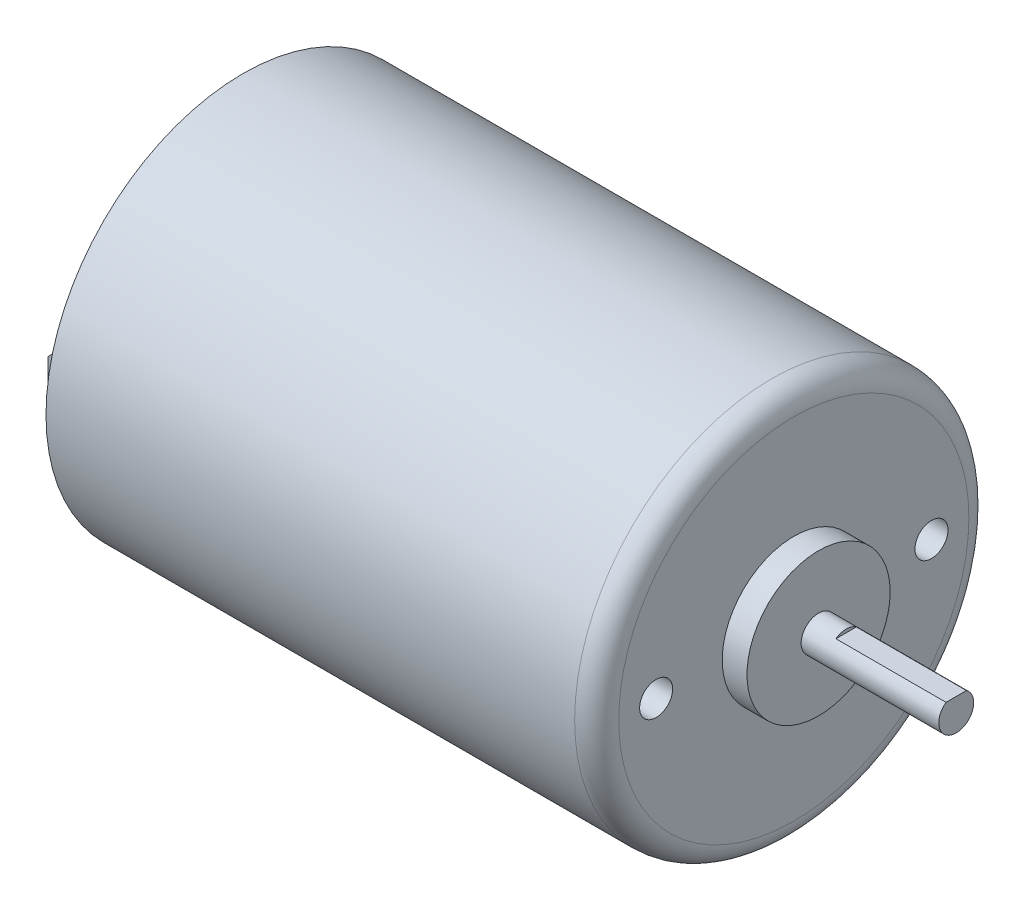
ISO-10303-21;
HEADER;
FILE_DESCRIPTION(('STEP AP214'),'2;1');
FILE_NAME('part.step','',(''),(''),'','','');
FILE_SCHEMA(('AUTOMOTIVE_DESIGN { 1 0 10303 214 1 1 1 1 }'));
ENDSEC;
DATA;
#1=APPLICATION_CONTEXT('core data for automotive mechanical design processes');
#2=APPLICATION_PROTOCOL_DEFINITION('international standard','automotive_design',2000,#1);
#3=PRODUCT_CONTEXT('',#1,'mechanical');
#4=PRODUCT('Part','Part','',(#3));
#5=PRODUCT_RELATED_PRODUCT_CATEGORY('part','',(#4));
#6=PRODUCT_DEFINITION_FORMATION('','',#4);
#7=PRODUCT_DEFINITION_CONTEXT('part definition',#1,'design');
#8=PRODUCT_DEFINITION('design','',#6,#7);
#9=PRODUCT_DEFINITION_SHAPE('','',#8);
#10=(LENGTH_UNIT() NAMED_UNIT(*) SI_UNIT(.MILLI.,.METRE.));
#11=(NAMED_UNIT(*) PLANE_ANGLE_UNIT() SI_UNIT($,.RADIAN.));
#12=(NAMED_UNIT(*) SI_UNIT($,.STERADIAN.) SOLID_ANGLE_UNIT());
#13=UNCERTAINTY_MEASURE_WITH_UNIT(LENGTH_MEASURE(1.E-05),#10,'distance_accuracy_value','');
#14=(GEOMETRIC_REPRESENTATION_CONTEXT(3) GLOBAL_UNCERTAINTY_ASSIGNED_CONTEXT((#13)) GLOBAL_UNIT_ASSIGNED_CONTEXT((#10,
#11,#12)) REPRESENTATION_CONTEXT('',''));
#15=CARTESIAN_POINT('',(0.,0.,0.));
#16=DIRECTION('',(0.,0.,1.));
#17=DIRECTION('',(1.,0.,0.));
#18=AXIS2_PLACEMENT_3D('',#15,#16,#17);
#19=CARTESIAN_POINT('',(-24.5,0.,0.));
#20=DIRECTION('',(-1.,0.,0.));
#21=DIRECTION('',(0.,0.,1.));
#22=AXIS2_PLACEMENT_3D('',#19,#20,#21);
#23=PLANE('',#22);
#24=CARTESIAN_POINT('',(-24.5,0.,0.));
#25=DIRECTION('',(-1.,0.,0.));
#26=DIRECTION('',(0.,0.,1.));
#27=AXIS2_PLACEMENT_3D('',#24,#25,#26);
#28=CIRCLE('',#27,12.);
#29=CARTESIAN_POINT('',(-24.5,0.,12.));
#30=VERTEX_POINT('',#29);
#31=EDGE_CURVE('E249',#30,#30,#28,.F.);
#32=ORIENTED_EDGE('',*,*,#31,.T.);
#33=EDGE_LOOP('',(#32));
#34=FACE_BOUND('',#33,.T.);
#35=CARTESIAN_POINT('',(-24.5,0.,0.));
#36=DIRECTION('',(-1.,0.,0.));
#37=DIRECTION('',(0.,0.,1.));
#38=AXIS2_PLACEMENT_3D('',#35,#36,#37);
#39=CIRCLE('',#38,17.2);
#40=CARTESIAN_POINT('',(-24.5,0.,17.2));
#41=VERTEX_POINT('',#40);
#42=EDGE_CURVE('E250',#41,#41,#39,.T.);
#43=ORIENTED_EDGE('',*,*,#42,.T.);
#44=EDGE_LOOP('',(#43));
#45=FACE_BOUND('',#44,.T.);
#46=DIRECTION('',(0.,0.,-1.));
#47=VECTOR('',#46,1.);
#48=CARTESIAN_POINT('',(-24.5,2.00000000000001,-14.2));
#49=LINE('',#48,#47);
#50=CARTESIAN_POINT('',(-24.5,2.00000000000001,-13.7));
#51=VERTEX_POINT('',#50);
#52=CARTESIAN_POINT('',(-24.5,2.00000000000001,-14.2));
#53=VERTEX_POINT('',#52);
#54=EDGE_CURVE('E226',#51,#53,#49,.T.);
#55=ORIENTED_EDGE('',*,*,#54,.F.);
#56=DIRECTION('',(0.,1.,0.));
#57=VECTOR('',#56,1.);
#58=CARTESIAN_POINT('',(-24.5,2.00000000000001,-13.7));
#59=LINE('',#58,#57);
#60=CARTESIAN_POINT('',(-24.5,-1.99999999999999,-13.7));
#61=VERTEX_POINT('',#60);
#62=EDGE_CURVE('E211',#61,#51,#59,.T.);
#63=ORIENTED_EDGE('',*,*,#62,.F.);
#64=DIRECTION('',(0.,0.,1.));
#65=VECTOR('',#64,1.);
#66=CARTESIAN_POINT('',(-24.5,-1.99999999999999,-14.2));
#67=LINE('',#66,#65);
#68=CARTESIAN_POINT('',(-24.5,-1.99999999999999,-14.2));
#69=VERTEX_POINT('',#68);
#70=EDGE_CURVE('E220',#69,#61,#67,.T.);
#71=ORIENTED_EDGE('',*,*,#70,.F.);
#72=DIRECTION('',(0.,-1.,0.));
#73=VECTOR('',#72,1.);
#74=CARTESIAN_POINT('',(-24.5,2.00000000000001,-14.2));
#75=LINE('',#74,#73);
#76=EDGE_CURVE('E229',#53,#69,#75,.T.);
#77=ORIENTED_EDGE('',*,*,#76,.F.);
#78=EDGE_LOOP('',(#55,#63,#71,#77));
#79=FACE_BOUND('',#78,.T.);
#80=DIRECTION('',(0.,0.,-1.));
#81=VECTOR('',#80,1.);
#82=CARTESIAN_POINT('',(-24.5,2.00000000000001,14.2));
#83=LINE('',#82,#81);
#84=CARTESIAN_POINT('',(-24.5,2.00000000000001,14.2));
#85=VERTEX_POINT('',#84);
#86=CARTESIAN_POINT('',(-24.5,2.00000000000001,13.7));
#87=VERTEX_POINT('',#86);
#88=EDGE_CURVE('E205',#85,#87,#83,.T.);
#89=ORIENTED_EDGE('',*,*,#88,.F.);
#90=DIRECTION('',(0.,1.,0.));
#91=VECTOR('',#90,1.);
#92=CARTESIAN_POINT('',(-24.5,2.00000000000001,14.2));
#93=LINE('',#92,#91);
#94=CARTESIAN_POINT('',(-24.5,-1.99999999999999,14.2));
#95=VERTEX_POINT('',#94);
#96=EDGE_CURVE('E208',#95,#85,#93,.T.);
#97=ORIENTED_EDGE('',*,*,#96,.F.);
#98=DIRECTION('',(0.,0.,1.));
#99=VECTOR('',#98,1.);
#100=CARTESIAN_POINT('',(-24.5,-1.99999999999999,14.2));
#101=LINE('',#100,#99);
#102=CARTESIAN_POINT('',(-24.5,-1.99999999999999,13.7));
#103=VERTEX_POINT('',#102);
#104=EDGE_CURVE('E198',#103,#95,#101,.T.);
#105=ORIENTED_EDGE('',*,*,#104,.F.);
#106=DIRECTION('',(0.,-1.,0.));
#107=VECTOR('',#106,1.);
#108=CARTESIAN_POINT('',(-24.5,2.00000000000001,13.7));
#109=LINE('',#108,#107);
#110=EDGE_CURVE('E201',#87,#103,#109,.T.);
#111=ORIENTED_EDGE('',*,*,#110,.F.);
#112=EDGE_LOOP('',(#89,#97,#105,#111));
#113=FACE_BOUND('',#112,.T.);
#114=ADVANCED_FACE('F49',(#34,#45,#79,#113),#23,.T.);
#115=CARTESIAN_POINT('',(25.,0.,0.));
#116=DIRECTION('',(-1.,0.,0.));
#117=DIRECTION('',(0.,0.,1.));
#118=AXIS2_PLACEMENT_3D('',#115,#116,#117);
#119=CYLINDRICAL_SURFACE('',#118,17.9);
#120=CARTESIAN_POINT('',(23.,0.,0.));
#121=DIRECTION('',(1.,0.,0.));
#122=DIRECTION('',(0.,0.,-1.));
#123=AXIS2_PLACEMENT_3D('',#120,#121,#122);
#124=CIRCLE('',#123,17.9);
#125=CARTESIAN_POINT('',(23.,0.,-17.9));
#126=VERTEX_POINT('',#125);
#127=EDGE_CURVE('E267',#126,#126,#124,.F.);
#128=ORIENTED_EDGE('',*,*,#127,.T.);
#129=EDGE_LOOP('',(#128));
#130=FACE_BOUND('',#129,.T.);
#131=CARTESIAN_POINT('',(-25.,0.,0.));
#132=DIRECTION('',(1.,0.,0.));
#133=DIRECTION('',(0.,0.,-1.));
#134=AXIS2_PLACEMENT_3D('',#131,#132,#133);
#135=CIRCLE('',#134,17.9);
#136=CARTESIAN_POINT('',(-25.,0.,-17.9));
#137=VERTEX_POINT('',#136);
#138=EDGE_CURVE('E253',#137,#137,#135,.T.);
#139=ORIENTED_EDGE('',*,*,#138,.T.);
#140=EDGE_LOOP('',(#139));
#141=FACE_BOUND('',#140,.T.);
#142=ADVANCED_FACE('F331',(#130,#141),#119,.T.);
#143=CARTESIAN_POINT('',(25.,0.,0.));
#144=DIRECTION('',(1.,0.,0.));
#145=DIRECTION('',(0.,0.,-1.));
#146=AXIS2_PLACEMENT_3D('',#143,#144,#145);
#147=PLANE('',#146);
#148=CARTESIAN_POINT('',(25.,0.,0.));
#149=DIRECTION('',(1.,0.,0.));
#150=DIRECTION('',(0.,0.,-1.));
#151=AXIS2_PLACEMENT_3D('',#148,#149,#150);
#152=CIRCLE('',#151,6.5);
#153=CARTESIAN_POINT('',(25.,0.,-6.5));
#154=VERTEX_POINT('',#153);
#155=EDGE_CURVE('E54',#154,#154,#152,.F.);
#156=ORIENTED_EDGE('',*,*,#155,.T.);
#157=EDGE_LOOP('',(#156));
#158=FACE_BOUND('',#157,.T.);
#159=CARTESIAN_POINT('',(25.,0.,12.5));
#160=DIRECTION('',(1.,0.,0.));
#161=DIRECTION('',(0.,0.,-1.));
#162=AXIS2_PLACEMENT_3D('',#159,#160,#161);
#163=CIRCLE('',#162,1.5);
#164=CARTESIAN_POINT('',(25.,0.,11.));
#165=VERTEX_POINT('',#164);
#166=EDGE_CURVE('E181',#165,#165,#163,.T.);
#167=ORIENTED_EDGE('',*,*,#166,.F.);
#168=EDGE_LOOP('',(#167));
#169=FACE_BOUND('',#168,.T.);
#170=CARTESIAN_POINT('',(25.,0.,-12.5));
#171=DIRECTION('',(1.,0.,0.));
#172=DIRECTION('',(0.,0.,1.));
#173=AXIS2_PLACEMENT_3D('',#170,#171,#172);
#174=CIRCLE('',#173,1.5);
#175=CARTESIAN_POINT('',(25.,0.,-11.));
#176=VERTEX_POINT('',#175);
#177=EDGE_CURVE('E184',#176,#176,#174,.T.);
#178=ORIENTED_EDGE('',*,*,#177,.F.);
#179=EDGE_LOOP('',(#178));
#180=FACE_BOUND('',#179,.T.);
#181=CARTESIAN_POINT('',(25.,0.,0.));
#182=DIRECTION('',(1.,0.,0.));
#183=DIRECTION('',(0.,0.,-1.));
#184=AXIS2_PLACEMENT_3D('',#181,#182,#183);
#185=CIRCLE('',#184,15.9);
#186=CARTESIAN_POINT('',(25.,0.,-15.9));
#187=VERTEX_POINT('',#186);
#188=EDGE_CURVE('E259',#187,#187,#185,.T.);
#189=ORIENTED_EDGE('',*,*,#188,.T.);
#190=EDGE_LOOP('',(#189));
#191=FACE_BOUND('',#190,.T.);
#192=ADVANCED_FACE('F390',(#158,#169,#180,#191),#147,.T.);
#193=CARTESIAN_POINT('',(-25.,0.,0.));
#194=DIRECTION('',(1.,0.,0.));
#195=DIRECTION('',(0.,0.,-1.));
#196=AXIS2_PLACEMENT_3D('',#193,#194,#195);
#197=PLANE('',#196);
#198=CARTESIAN_POINT('',(-25.,0.,0.));
#199=DIRECTION('',(-1.,0.,0.));
#200=DIRECTION('',(0.,0.,1.));
#201=AXIS2_PLACEMENT_3D('',#198,#199,#200);
#202=CIRCLE('',#201,17.2);
#203=CARTESIAN_POINT('',(-25.,0.,17.2));
#204=VERTEX_POINT('',#203);
#205=EDGE_CURVE('E254',#204,#204,#202,.T.);
#206=ORIENTED_EDGE('',*,*,#205,.F.);
#207=EDGE_LOOP('',(#206));
#208=FACE_BOUND('',#207,.T.);
#209=ORIENTED_EDGE('',*,*,#138,.F.);
#210=EDGE_LOOP('',(#209));
#211=FACE_BOUND('',#210,.T.);
#212=ADVANCED_FACE('F392',(#208,#211),#197,.F.);
#213=CARTESIAN_POINT('',(-24.5,0.,0.));
#214=DIRECTION('',(-1.,0.,0.));
#215=DIRECTION('',(0.,0.,1.));
#216=AXIS2_PLACEMENT_3D('',#213,#214,#215);
#217=CYLINDRICAL_SURFACE('',#216,17.2);
#218=ORIENTED_EDGE('',*,*,#42,.F.);
#219=EDGE_LOOP('',(#218));
#220=FACE_BOUND('',#219,.T.);
#221=ORIENTED_EDGE('',*,*,#205,.T.);
#222=EDGE_LOOP('',(#221));
#223=FACE_BOUND('',#222,.T.);
#224=ADVANCED_FACE('F395',(#220,#223),#217,.F.);
#225=CARTESIAN_POINT('',(-25.,0.,0.));
#226=DIRECTION('',(1.,0.,0.));
#227=DIRECTION('',(0.,0.,-1.));
#228=AXIS2_PLACEMENT_3D('',#225,#226,#227);
#229=CYLINDRICAL_SURFACE('',#228,12.);
#230=ORIENTED_EDGE('',*,*,#31,.F.);
#231=EDGE_LOOP('',(#230));
#232=FACE_BOUND('',#231,.T.);
#233=CARTESIAN_POINT('',(-25.,0.,0.));
#234=DIRECTION('',(-1.,0.,0.));
#235=DIRECTION('',(0.,0.,1.));
#236=AXIS2_PLACEMENT_3D('',#233,#234,#235);
#237=CIRCLE('',#236,12.);
#238=CARTESIAN_POINT('',(-25.,0.,12.));
#239=VERTEX_POINT('',#238);
#240=EDGE_CURVE('E245',#239,#239,#237,.T.);
#241=ORIENTED_EDGE('',*,*,#240,.F.);
#242=EDGE_LOOP('',(#241));
#243=FACE_BOUND('',#242,.T.);
#244=ADVANCED_FACE('F401',(#232,#243),#229,.T.);
#245=CARTESIAN_POINT('',(-25.,0.,0.));
#246=DIRECTION('',(-1.,0.,0.));
#247=DIRECTION('',(0.,0.,1.));
#248=AXIS2_PLACEMENT_3D('',#245,#246,#247);
#249=PLANE('',#248);
#250=CARTESIAN_POINT('',(-25.,0.,0.));
#251=DIRECTION('',(-1.,0.,0.));
#252=DIRECTION('',(0.,0.,1.));
#253=AXIS2_PLACEMENT_3D('',#250,#251,#252);
#254=CIRCLE('',#253,5.1);
#255=CARTESIAN_POINT('',(-25.,0.,5.1));
#256=VERTEX_POINT('',#255);
#257=EDGE_CURVE('E244',#256,#256,#254,.F.);
#258=ORIENTED_EDGE('',*,*,#257,.T.);
#259=EDGE_LOOP('',(#258));
#260=FACE_BOUND('',#259,.T.);
#261=ORIENTED_EDGE('',*,*,#240,.T.);
#262=EDGE_LOOP('',(#261));
#263=FACE_BOUND('',#262,.T.);
#264=ADVANCED_FACE('F406',(#260,#263),#249,.T.);
#265=CARTESIAN_POINT('',(-26.5,0.,0.));
#266=DIRECTION('',(1.,0.,0.));
#267=DIRECTION('',(0.,0.,-1.));
#268=AXIS2_PLACEMENT_3D('',#265,#266,#267);
#269=CYLINDRICAL_SURFACE('',#268,5.1);
#270=ORIENTED_EDGE('',*,*,#257,.F.);
#271=EDGE_LOOP('',(#270));
#272=FACE_BOUND('',#271,.T.);
#273=CARTESIAN_POINT('',(-26.5,0.,0.));
#274=DIRECTION('',(-1.,0.,0.));
#275=DIRECTION('',(0.,0.,1.));
#276=AXIS2_PLACEMENT_3D('',#273,#274,#275);
#277=CIRCLE('',#276,5.1);
#278=CARTESIAN_POINT('',(-26.5,0.,5.1));
#279=VERTEX_POINT('',#278);
#280=EDGE_CURVE('E241',#279,#279,#277,.T.);
#281=ORIENTED_EDGE('',*,*,#280,.F.);
#282=EDGE_LOOP('',(#281));
#283=FACE_BOUND('',#282,.T.);
#284=ADVANCED_FACE('F410',(#272,#283),#269,.T.);
#285=CARTESIAN_POINT('',(-26.5,0.,0.));
#286=DIRECTION('',(-1.,0.,0.));
#287=DIRECTION('',(0.,0.,1.));
#288=AXIS2_PLACEMENT_3D('',#285,#286,#287);
#289=PLANE('',#288);
#290=ORIENTED_EDGE('',*,*,#280,.T.);
#291=EDGE_LOOP('',(#290));
#292=FACE_BOUND('',#291,.T.);
#293=ADVANCED_FACE('F386',(#292),#289,.T.);
#294=CARTESIAN_POINT('',(23.,0.,0.));
#295=DIRECTION('',(1.,0.,0.));
#296=DIRECTION('',(0.,0.,-1.));
#297=AXIS2_PLACEMENT_3D('',#294,#295,#296);
#298=TOROIDAL_SURFACE('',#297,15.9,2.);
#299=ORIENTED_EDGE('',*,*,#127,.F.);
#300=EDGE_LOOP('',(#299));
#301=FACE_BOUND('',#300,.T.);
#302=ORIENTED_EDGE('',*,*,#188,.F.);
#303=EDGE_LOOP('',(#302));
#304=FACE_BOUND('',#303,.T.);
#305=ADVANCED_FACE('F383',(#301,#304),#298,.T.);
#306=CARTESIAN_POINT('',(-28.5,2.00000000000001,-13.7));
#307=DIRECTION('',(0.,0.,-1.));
#308=DIRECTION('',(-1.,0.,0.));
#309=AXIS2_PLACEMENT_3D('',#306,#307,#308);
#310=PLANE('',#309);
#311=DIRECTION('',(0.,1.,0.));
#312=VECTOR('',#311,1.);
#313=CARTESIAN_POINT('',(-28.5,2.00000000000001,-13.7));
#314=LINE('',#313,#312);
#315=CARTESIAN_POINT('',(-28.5,-0.999999999999993,-13.7));
#316=VERTEX_POINT('',#315);
#317=CARTESIAN_POINT('',(-28.5,1.00000000000001,-13.7));
#318=VERTEX_POINT('',#317);
#319=EDGE_CURVE('E216',#316,#318,#314,.T.);
#320=ORIENTED_EDGE('',*,*,#319,.F.);
#321=DIRECTION('',(0.707106781186552,-0.707106781186543,0.));
#322=VECTOR('',#321,1.);
#323=CARTESIAN_POINT('',(-28.5,-0.999999999999993,-13.7));
#324=LINE('',#323,#322);
#325=CARTESIAN_POINT('',(-27.5,-1.99999999999999,-13.7));
#326=VERTEX_POINT('',#325);
#327=EDGE_CURVE('E296',#316,#326,#324,.T.);
#328=ORIENTED_EDGE('',*,*,#327,.T.);
#329=DIRECTION('',(1.,0.,0.));
#330=VECTOR('',#329,1.);
#331=CARTESIAN_POINT('',(-28.5,-1.99999999999999,-13.7));
#332=LINE('',#331,#330);
#333=EDGE_CURVE('E223',#326,#61,#332,.T.);
#334=ORIENTED_EDGE('',*,*,#333,.T.);
#335=ORIENTED_EDGE('',*,*,#62,.T.);
#336=DIRECTION('',(1.,0.,0.));
#337=VECTOR('',#336,1.);
#338=CARTESIAN_POINT('',(-28.5,2.00000000000001,-13.7));
#339=LINE('',#338,#337);
#340=CARTESIAN_POINT('',(-27.5,2.00000000000001,-13.7));
#341=VERTEX_POINT('',#340);
#342=EDGE_CURVE('E239',#341,#51,#339,.T.);
#343=ORIENTED_EDGE('',*,*,#342,.F.);
#344=DIRECTION('',(-0.707106781186552,-0.707106781186543,0.));
#345=VECTOR('',#344,1.);
#346=CARTESIAN_POINT('',(-28.5,1.00000000000001,-13.7));
#347=LINE('',#346,#345);
#348=EDGE_CURVE('E294',#341,#318,#347,.T.);
#349=ORIENTED_EDGE('',*,*,#348,.T.);
#350=EDGE_LOOP('',(#320,#328,#334,#335,#343,#349));
#351=FACE_BOUND('',#350,.T.);
#352=ADVANCED_FACE('F310',(#351),#310,.F.);
#353=CARTESIAN_POINT('',(-28.5,2.00000000000001,-14.2));
#354=DIRECTION('',(0.,-1.,0.));
#355=DIRECTION('',(0.,0.,-1.));
#356=AXIS2_PLACEMENT_3D('',#353,#354,#355);
#357=PLANE('',#356);
#358=DIRECTION('',(1.,0.,0.));
#359=VECTOR('',#358,1.);
#360=CARTESIAN_POINT('',(-28.5,2.00000000000001,-14.2));
#361=LINE('',#360,#359);
#362=CARTESIAN_POINT('',(-27.5,2.00000000000001,-14.2));
#363=VERTEX_POINT('',#362);
#364=EDGE_CURVE('E237',#363,#53,#361,.T.);
#365=ORIENTED_EDGE('',*,*,#364,.F.);
#366=DIRECTION('',(0.,0.,1.));
#367=VECTOR('',#366,1.);
#368=CARTESIAN_POINT('',(-27.5,2.00000000000001,-13.7));
#369=LINE('',#368,#367);
#370=EDGE_CURVE('E59',#363,#341,#369,.T.);
#371=ORIENTED_EDGE('',*,*,#370,.T.);
#372=ORIENTED_EDGE('',*,*,#342,.T.);
#373=ORIENTED_EDGE('',*,*,#54,.T.);
#374=EDGE_LOOP('',(#365,#371,#372,#373));
#375=FACE_BOUND('',#374,.T.);
#376=ADVANCED_FACE('F305',(#375),#357,.F.);
#377=CARTESIAN_POINT('',(-28.5,2.00000000000001,-14.2));
#378=DIRECTION('',(0.,0.,1.));
#379=DIRECTION('',(1.,0.,0.));
#380=AXIS2_PLACEMENT_3D('',#377,#378,#379);
#381=PLANE('',#380);
#382=DIRECTION('',(1.,0.,0.));
#383=VECTOR('',#382,1.);
#384=CARTESIAN_POINT('',(-28.5,-1.99999999999999,-14.2));
#385=LINE('',#384,#383);
#386=CARTESIAN_POINT('',(-27.5,-1.99999999999999,-14.2));
#387=VERTEX_POINT('',#386);
#388=EDGE_CURVE('E235',#387,#69,#385,.T.);
#389=ORIENTED_EDGE('',*,*,#388,.F.);
#390=DIRECTION('',(-0.707106781186552,0.707106781186543,0.));
#391=VECTOR('',#390,1.);
#392=CARTESIAN_POINT('',(-28.5,-0.999999999999993,-14.2));
#393=LINE('',#392,#391);
#394=CARTESIAN_POINT('',(-28.5,-0.999999999999993,-14.2));
#395=VERTEX_POINT('',#394);
#396=EDGE_CURVE('E301',#387,#395,#393,.T.);
#397=ORIENTED_EDGE('',*,*,#396,.T.);
#398=DIRECTION('',(0.,-1.,0.));
#399=VECTOR('',#398,1.);
#400=CARTESIAN_POINT('',(-28.5,2.00000000000001,-14.2));
#401=LINE('',#400,#399);
#402=CARTESIAN_POINT('',(-28.5,1.00000000000001,-14.2));
#403=VERTEX_POINT('',#402);
#404=EDGE_CURVE('E219',#403,#395,#401,.T.);
#405=ORIENTED_EDGE('',*,*,#404,.F.);
#406=DIRECTION('',(0.707106781186552,0.707106781186543,0.));
#407=VECTOR('',#406,1.);
#408=CARTESIAN_POINT('',(-28.5,1.00000000000001,-14.2));
#409=LINE('',#408,#407);
#410=EDGE_CURVE('E75',#403,#363,#409,.T.);
#411=ORIENTED_EDGE('',*,*,#410,.T.);
#412=ORIENTED_EDGE('',*,*,#364,.T.);
#413=ORIENTED_EDGE('',*,*,#76,.T.);
#414=EDGE_LOOP('',(#389,#397,#405,#411,#412,#413));
#415=FACE_BOUND('',#414,.T.);
#416=ADVANCED_FACE('F318',(#415),#381,.F.);
#417=CARTESIAN_POINT('',(-28.5,-1.99999999999999,-14.2));
#418=DIRECTION('',(0.,1.,0.));
#419=DIRECTION('',(0.,0.,1.));
#420=AXIS2_PLACEMENT_3D('',#417,#418,#419);
#421=PLANE('',#420);
#422=ORIENTED_EDGE('',*,*,#333,.F.);
#423=DIRECTION('',(0.,0.,-1.));
#424=VECTOR('',#423,1.);
#425=CARTESIAN_POINT('',(-27.5,-1.99999999999999,-14.2));
#426=LINE('',#425,#424);
#427=EDGE_CURVE('E298',#326,#387,#426,.T.);
#428=ORIENTED_EDGE('',*,*,#427,.T.);
#429=ORIENTED_EDGE('',*,*,#388,.T.);
#430=ORIENTED_EDGE('',*,*,#70,.T.);
#431=EDGE_LOOP('',(#422,#428,#429,#430));
#432=FACE_BOUND('',#431,.T.);
#433=ADVANCED_FACE('F325',(#432),#421,.F.);
#434=CARTESIAN_POINT('',(-28.5,0.,0.));
#435=DIRECTION('',(-1.,0.,0.));
#436=DIRECTION('',(0.,0.,1.));
#437=AXIS2_PLACEMENT_3D('',#434,#435,#436);
#438=PLANE('',#437);
#439=ORIENTED_EDGE('',*,*,#404,.T.);
#440=DIRECTION('',(0.,0.,1.));
#441=VECTOR('',#440,1.);
#442=CARTESIAN_POINT('',(-28.5,-0.999999999999993,-13.7));
#443=LINE('',#442,#441);
#444=EDGE_CURVE('E291',#395,#316,#443,.T.);
#445=ORIENTED_EDGE('',*,*,#444,.T.);
#446=ORIENTED_EDGE('',*,*,#319,.T.);
#447=DIRECTION('',(0.,0.,-1.));
#448=VECTOR('',#447,1.);
#449=CARTESIAN_POINT('',(-28.5,1.00000000000001,-14.2));
#450=LINE('',#449,#448);
#451=EDGE_CURVE('E288',#318,#403,#450,.T.);
#452=ORIENTED_EDGE('',*,*,#451,.T.);
#453=EDGE_LOOP('',(#439,#445,#446,#452));
#454=FACE_BOUND('',#453,.T.);
#455=ADVANCED_FACE('F315',(#454),#438,.T.);
#456=CARTESIAN_POINT('',(-28.5,2.00000000000001,14.2));
#457=DIRECTION('',(0.,0.,-1.));
#458=DIRECTION('',(-1.,0.,0.));
#459=AXIS2_PLACEMENT_3D('',#456,#457,#458);
#460=PLANE('',#459);
#461=DIRECTION('',(1.,0.,0.));
#462=VECTOR('',#461,1.);
#463=CARTESIAN_POINT('',(-28.5,2.00000000000001,14.2));
#464=LINE('',#463,#462);
#465=CARTESIAN_POINT('',(-27.5,2.00000000000001,14.2));
#466=VERTEX_POINT('',#465);
#467=EDGE_CURVE('E180',#466,#85,#464,.T.);
#468=ORIENTED_EDGE('',*,*,#467,.F.);
#469=DIRECTION('',(0.707106781186552,0.707106781186543,0.));
#470=VECTOR('',#469,1.);
#471=CARTESIAN_POINT('',(-28.5,1.00000000000001,14.2));
#472=LINE('',#471,#470);
#473=CARTESIAN_POINT('',(-28.5,1.00000000000001,14.2));
#474=VERTEX_POINT('',#473);
#475=EDGE_CURVE('E284',#466,#474,#472,.F.);
#476=ORIENTED_EDGE('',*,*,#475,.T.);
#477=DIRECTION('',(0.,1.,0.));
#478=VECTOR('',#477,1.);
#479=CARTESIAN_POINT('',(-28.5,2.00000000000001,14.2));
#480=LINE('',#479,#478);
#481=CARTESIAN_POINT('',(-28.5,-0.999999999999993,14.2));
#482=VERTEX_POINT('',#481);
#483=EDGE_CURVE('E202',#482,#474,#480,.T.);
#484=ORIENTED_EDGE('',*,*,#483,.F.);
#485=DIRECTION('',(-0.707106781186552,0.707106781186543,0.));
#486=VECTOR('',#485,1.);
#487=CARTESIAN_POINT('',(-28.5,-0.999999999999993,14.2));
#488=LINE('',#487,#486);
#489=CARTESIAN_POINT('',(-27.5,-1.99999999999999,14.2));
#490=VERTEX_POINT('',#489);
#491=EDGE_CURVE('E282',#482,#490,#488,.F.);
#492=ORIENTED_EDGE('',*,*,#491,.T.);
#493=DIRECTION('',(1.,0.,0.));
#494=VECTOR('',#493,1.);
#495=CARTESIAN_POINT('',(-28.5,-1.99999999999999,14.2));
#496=LINE('',#495,#494);
#497=EDGE_CURVE('E195',#490,#95,#496,.T.);
#498=ORIENTED_EDGE('',*,*,#497,.T.);
#499=ORIENTED_EDGE('',*,*,#96,.T.);
#500=EDGE_LOOP('',(#468,#476,#484,#492,#498,#499));
#501=FACE_BOUND('',#500,.T.);
#502=ADVANCED_FACE('F345',(#501),#460,.F.);
#503=CARTESIAN_POINT('',(-28.5,2.00000000000001,14.2));
#504=DIRECTION('',(0.,-1.,0.));
#505=DIRECTION('',(0.,0.,-1.));
#506=AXIS2_PLACEMENT_3D('',#503,#504,#505);
#507=PLANE('',#506);
#508=DIRECTION('',(1.,0.,0.));
#509=VECTOR('',#508,1.);
#510=CARTESIAN_POINT('',(-28.5,2.00000000000001,13.7));
#511=LINE('',#510,#509);
#512=CARTESIAN_POINT('',(-27.5,2.00000000000001,13.7));
#513=VERTEX_POINT('',#512);
#514=EDGE_CURVE('E191',#513,#87,#511,.T.);
#515=ORIENTED_EDGE('',*,*,#514,.F.);
#516=DIRECTION('',(0.,0.,1.));
#517=VECTOR('',#516,1.);
#518=CARTESIAN_POINT('',(-27.5,2.00000000000001,14.2));
#519=LINE('',#518,#517);
#520=EDGE_CURVE('E280',#513,#466,#519,.T.);
#521=ORIENTED_EDGE('',*,*,#520,.T.);
#522=ORIENTED_EDGE('',*,*,#467,.T.);
#523=ORIENTED_EDGE('',*,*,#88,.T.);
#524=EDGE_LOOP('',(#515,#521,#522,#523));
#525=FACE_BOUND('',#524,.T.);
#526=ADVANCED_FACE('F340',(#525),#507,.F.);
#527=CARTESIAN_POINT('',(-28.5,2.00000000000001,13.7));
#528=DIRECTION('',(0.,0.,1.));
#529=DIRECTION('',(1.,0.,0.));
#530=AXIS2_PLACEMENT_3D('',#527,#528,#529);
#531=PLANE('',#530);
#532=DIRECTION('',(0.,-1.,0.));
#533=VECTOR('',#532,1.);
#534=CARTESIAN_POINT('',(-28.5,2.00000000000001,13.7));
#535=LINE('',#534,#533);
#536=CARTESIAN_POINT('',(-28.5,1.00000000000001,13.7));
#537=VERTEX_POINT('',#536);
#538=CARTESIAN_POINT('',(-28.5,-0.999999999999993,13.7));
#539=VERTEX_POINT('',#538);
#540=EDGE_CURVE('E197',#537,#539,#535,.T.);
#541=ORIENTED_EDGE('',*,*,#540,.F.);
#542=DIRECTION('',(-0.707106781186552,-0.707106781186543,0.));
#543=VECTOR('',#542,1.);
#544=CARTESIAN_POINT('',(-28.5,1.00000000000001,13.7));
#545=LINE('',#544,#543);
#546=EDGE_CURVE('E278',#537,#513,#545,.F.);
#547=ORIENTED_EDGE('',*,*,#546,.T.);
#548=ORIENTED_EDGE('',*,*,#514,.T.);
#549=ORIENTED_EDGE('',*,*,#110,.T.);
#550=DIRECTION('',(1.,0.,0.));
#551=VECTOR('',#550,1.);
#552=CARTESIAN_POINT('',(-28.5,-1.99999999999999,13.7));
#553=LINE('',#552,#551);
#554=CARTESIAN_POINT('',(-27.5,-1.99999999999999,13.7));
#555=VERTEX_POINT('',#554);
#556=EDGE_CURVE('E193',#555,#103,#553,.T.);
#557=ORIENTED_EDGE('',*,*,#556,.F.);
#558=DIRECTION('',(0.707106781186552,-0.707106781186543,0.));
#559=VECTOR('',#558,1.);
#560=CARTESIAN_POINT('',(-28.5,-0.999999999999993,13.7));
#561=LINE('',#560,#559);
#562=EDGE_CURVE('E276',#555,#539,#561,.F.);
#563=ORIENTED_EDGE('',*,*,#562,.T.);
#564=EDGE_LOOP('',(#541,#547,#548,#549,#557,#563));
#565=FACE_BOUND('',#564,.T.);
#566=ADVANCED_FACE('F355',(#565),#531,.F.);
#567=CARTESIAN_POINT('',(-28.5,-1.99999999999999,14.2));
#568=DIRECTION('',(0.,1.,0.));
#569=DIRECTION('',(0.,0.,1.));
#570=AXIS2_PLACEMENT_3D('',#567,#568,#569);
#571=PLANE('',#570);
#572=ORIENTED_EDGE('',*,*,#497,.F.);
#573=DIRECTION('',(0.,0.,-1.));
#574=VECTOR('',#573,1.);
#575=CARTESIAN_POINT('',(-27.5,-1.99999999999999,14.2));
#576=LINE('',#575,#574);
#577=EDGE_CURVE('E286',#490,#555,#576,.T.);
#578=ORIENTED_EDGE('',*,*,#577,.T.);
#579=ORIENTED_EDGE('',*,*,#556,.T.);
#580=ORIENTED_EDGE('',*,*,#104,.T.);
#581=EDGE_LOOP('',(#572,#578,#579,#580));
#582=FACE_BOUND('',#581,.T.);
#583=ADVANCED_FACE('F350',(#582),#571,.F.);
#584=CARTESIAN_POINT('',(-28.5,0.,0.));
#585=DIRECTION('',(1.,0.,0.));
#586=DIRECTION('',(0.,0.,-1.));
#587=AXIS2_PLACEMENT_3D('',#584,#585,#586);
#588=PLANE('',#587);
#589=ORIENTED_EDGE('',*,*,#483,.T.);
#590=DIRECTION('',(0.,0.,-1.));
#591=VECTOR('',#590,1.);
#592=CARTESIAN_POINT('',(-28.5,1.00000000000001,0.));
#593=LINE('',#592,#591);
#594=EDGE_CURVE('E273',#474,#537,#593,.T.);
#595=ORIENTED_EDGE('',*,*,#594,.T.);
#596=ORIENTED_EDGE('',*,*,#540,.T.);
#597=DIRECTION('',(0.,0.,1.));
#598=VECTOR('',#597,1.);
#599=CARTESIAN_POINT('',(-28.5,-0.999999999999993,0.));
#600=LINE('',#599,#598);
#601=EDGE_CURVE('E270',#539,#482,#600,.T.);
#602=ORIENTED_EDGE('',*,*,#601,.T.);
#603=EDGE_LOOP('',(#589,#595,#596,#602));
#604=FACE_BOUND('',#603,.T.);
#605=ADVANCED_FACE('F360',(#604),#588,.F.);
#606=CARTESIAN_POINT('',(-28.5,1.00000000000001,0.));
#607=DIRECTION('',(0.707106781186542,-0.707106781186552,0.));
#608=DIRECTION('',(0.,0.,-1.));
#609=AXIS2_PLACEMENT_3D('',#606,#607,#608);
#610=PLANE('',#609);
#611=ORIENTED_EDGE('',*,*,#475,.F.);
#612=ORIENTED_EDGE('',*,*,#520,.F.);
#613=ORIENTED_EDGE('',*,*,#546,.F.);
#614=ORIENTED_EDGE('',*,*,#594,.F.);
#615=EDGE_LOOP('',(#611,#612,#613,#614));
#616=FACE_BOUND('',#615,.T.);
#617=ADVANCED_FACE('F358',(#616),#610,.F.);
#618=CARTESIAN_POINT('',(-28.5,-0.999999999999993,0.));
#619=DIRECTION('',(0.707106781186542,0.707106781186552,0.));
#620=DIRECTION('',(0.,0.,1.));
#621=AXIS2_PLACEMENT_3D('',#618,#619,#620);
#622=PLANE('',#621);
#623=ORIENTED_EDGE('',*,*,#562,.F.);
#624=ORIENTED_EDGE('',*,*,#577,.F.);
#625=ORIENTED_EDGE('',*,*,#491,.F.);
#626=ORIENTED_EDGE('',*,*,#601,.F.);
#627=EDGE_LOOP('',(#623,#624,#625,#626));
#628=FACE_BOUND('',#627,.T.);
#629=ADVANCED_FACE('F363',(#628),#622,.F.);
#630=CARTESIAN_POINT('',(-28.5,-0.999999999999993,0.));
#631=DIRECTION('',(-0.707106781186542,-0.707106781186552,0.));
#632=DIRECTION('',(0.,0.,-1.));
#633=AXIS2_PLACEMENT_3D('',#630,#631,#632);
#634=PLANE('',#633);
#635=ORIENTED_EDGE('',*,*,#396,.F.);
#636=ORIENTED_EDGE('',*,*,#427,.F.);
#637=ORIENTED_EDGE('',*,*,#327,.F.);
#638=ORIENTED_EDGE('',*,*,#444,.F.);
#639=EDGE_LOOP('',(#635,#636,#637,#638));
#640=FACE_BOUND('',#639,.T.);
#641=ADVANCED_FACE('F322',(#640),#634,.T.);
#642=CARTESIAN_POINT('',(-28.5,1.00000000000001,0.));
#643=DIRECTION('',(-0.707106781186542,0.707106781186552,0.));
#644=DIRECTION('',(0.,0.,1.));
#645=AXIS2_PLACEMENT_3D('',#642,#643,#644);
#646=PLANE('',#645);
#647=ORIENTED_EDGE('',*,*,#348,.F.);
#648=ORIENTED_EDGE('',*,*,#370,.F.);
#649=ORIENTED_EDGE('',*,*,#410,.F.);
#650=ORIENTED_EDGE('',*,*,#451,.F.);
#651=EDGE_LOOP('',(#647,#648,#649,#650));
#652=FACE_BOUND('',#651,.T.);
#653=ADVANCED_FACE('F52',(#652),#646,.T.);
#654=CARTESIAN_POINT('',(19.,0.,-12.5));
#655=DIRECTION('',(1.,0.,0.));
#656=DIRECTION('',(0.,0.,-1.));
#657=AXIS2_PLACEMENT_3D('',#654,#655,#656);
#658=CYLINDRICAL_SURFACE('',#657,1.5);
#659=CARTESIAN_POINT('',(19.,0.,-12.5));
#660=DIRECTION('',(1.,0.,0.));
#661=DIRECTION('',(0.,0.,1.));
#662=AXIS2_PLACEMENT_3D('',#659,#660,#661);
#663=CIRCLE('',#662,1.5);
#664=CARTESIAN_POINT('',(19.,0.,-11.));
#665=VERTEX_POINT('',#664);
#666=EDGE_CURVE('E187',#665,#665,#663,.T.);
#667=ORIENTED_EDGE('',*,*,#666,.F.);
#668=EDGE_LOOP('',(#667));
#669=FACE_BOUND('',#668,.T.);
#670=ORIENTED_EDGE('',*,*,#177,.T.);
#671=EDGE_LOOP('',(#670));
#672=FACE_BOUND('',#671,.T.);
#673=ADVANCED_FACE('F442',(#669,#672),#658,.F.);
#674=CARTESIAN_POINT('',(19.,0.,-12.5));
#675=DIRECTION('',(-1.,0.,0.));
#676=DIRECTION('',(0.,0.,1.));
#677=AXIS2_PLACEMENT_3D('',#674,#675,#676);
#678=PLANE('',#677);
#679=ORIENTED_EDGE('',*,*,#666,.T.);
#680=EDGE_LOOP('',(#679));
#681=FACE_BOUND('',#680,.T.);
#682=ADVANCED_FACE('F438',(#681),#678,.F.);
#683=CARTESIAN_POINT('',(19.,0.,12.5));
#684=DIRECTION('',(1.,0.,0.));
#685=DIRECTION('',(0.,0.,-1.));
#686=AXIS2_PLACEMENT_3D('',#683,#684,#685);
#687=CYLINDRICAL_SURFACE('',#686,1.5);
#688=CARTESIAN_POINT('',(19.,0.,12.5));
#689=DIRECTION('',(1.,0.,0.));
#690=DIRECTION('',(0.,0.,-1.));
#691=AXIS2_PLACEMENT_3D('',#688,#689,#690);
#692=CIRCLE('',#691,1.5);
#693=CARTESIAN_POINT('',(19.,0.,11.));
#694=VERTEX_POINT('',#693);
#695=EDGE_CURVE('E177',#694,#694,#692,.T.);
#696=ORIENTED_EDGE('',*,*,#695,.F.);
#697=EDGE_LOOP('',(#696));
#698=FACE_BOUND('',#697,.T.);
#699=ORIENTED_EDGE('',*,*,#166,.T.);
#700=EDGE_LOOP('',(#699));
#701=FACE_BOUND('',#700,.T.);
#702=ADVANCED_FACE('F441',(#698,#701),#687,.F.);
#703=CARTESIAN_POINT('',(19.,0.,12.5));
#704=DIRECTION('',(1.,0.,0.));
#705=DIRECTION('',(0.,0.,-1.));
#706=AXIS2_PLACEMENT_3D('',#703,#704,#705);
#707=PLANE('',#706);
#708=ORIENTED_EDGE('',*,*,#695,.T.);
#709=EDGE_LOOP('',(#708));
#710=FACE_BOUND('',#709,.T.);
#711=ADVANCED_FACE('F449',(#710),#707,.T.);
#712=CARTESIAN_POINT('',(27.25,0.,0.));
#713=DIRECTION('',(-1.,0.,0.));
#714=DIRECTION('',(0.,0.,1.));
#715=AXIS2_PLACEMENT_3D('',#712,#713,#714);
#716=CYLINDRICAL_SURFACE('',#715,6.5);
#717=ORIENTED_EDGE('',*,*,#155,.F.);
#718=EDGE_LOOP('',(#717));
#719=FACE_BOUND('',#718,.T.);
#720=CARTESIAN_POINT('',(27.25,0.,0.));
#721=DIRECTION('',(1.,0.,0.));
#722=DIRECTION('',(0.,0.,-1.));
#723=AXIS2_PLACEMENT_3D('',#720,#721,#722);
#724=CIRCLE('',#723,6.5);
#725=CARTESIAN_POINT('',(27.25,0.,-6.5));
#726=VERTEX_POINT('',#725);
#727=EDGE_CURVE('E173',#726,#726,#724,.T.);
#728=ORIENTED_EDGE('',*,*,#727,.F.);
#729=EDGE_LOOP('',(#728));
#730=FACE_BOUND('',#729,.T.);
#731=ADVANCED_FACE('F453',(#719,#730),#716,.T.);
#732=CARTESIAN_POINT('',(27.25,0.,0.));
#733=DIRECTION('',(1.,0.,0.));
#734=DIRECTION('',(0.,0.,-1.));
#735=AXIS2_PLACEMENT_3D('',#732,#733,#734);
#736=PLANE('',#735);
#737=CARTESIAN_POINT('',(27.25,0.,0.));
#738=DIRECTION('',(1.,0.,0.));
#739=DIRECTION('',(0.,0.,-1.));
#740=AXIS2_PLACEMENT_3D('',#737,#738,#739);
#741=CIRCLE('',#740,1.585);
#742=CARTESIAN_POINT('',(27.25,0.,-1.585));
#743=VERTEX_POINT('',#742);
#744=EDGE_CURVE('E11',#743,#743,#741,.T.);
#745=ORIENTED_EDGE('',*,*,#744,.F.);
#746=EDGE_LOOP('',(#745));
#747=FACE_BOUND('',#746,.T.);
#748=ORIENTED_EDGE('',*,*,#727,.T.);
#749=EDGE_LOOP('',(#748));
#750=FACE_BOUND('',#749,.T.);
#751=ADVANCED_FACE('F457',(#747,#750),#736,.T.);
#752=CARTESIAN_POINT('',(39.75,0.,0.));
#753=DIRECTION('',(-1.,0.,0.));
#754=DIRECTION('',(0.,0.,1.));
#755=AXIS2_PLACEMENT_3D('',#752,#753,#754);
#756=CYLINDRICAL_SURFACE('',#755,1.585);
#757=CARTESIAN_POINT('',(39.75,0.,0.));
#758=DIRECTION('',(1.,0.,0.));
#759=DIRECTION('',(0.,0.,-1.));
#760=AXIS2_PLACEMENT_3D('',#757,#758,#759);
#761=CIRCLE('',#760,1.585);
#762=CARTESIAN_POINT('',(39.75,1.285,0.927900856772964));
#763=VERTEX_POINT('',#762);
#764=CARTESIAN_POINT('',(39.75,1.285,-0.927900856772964));
#765=VERTEX_POINT('',#764);
#766=EDGE_CURVE('E168',#763,#765,#761,.T.);
#767=ORIENTED_EDGE('',*,*,#766,.F.);
#768=DIRECTION('',(1.,0.,0.));
#769=VECTOR('',#768,1.);
#770=CARTESIAN_POINT('',(29.75,1.285,0.927900856772964));
#771=LINE('',#770,#769);
#772=CARTESIAN_POINT('',(29.75,1.285,0.927900856772964));
#773=VERTEX_POINT('',#772);
#774=EDGE_CURVE('E67',#773,#763,#771,.T.);
#775=ORIENTED_EDGE('',*,*,#774,.F.);
#776=CARTESIAN_POINT('',(29.75,0.,0.));
#777=DIRECTION('',(1.,0.,0.));
#778=DIRECTION('',(0.,0.,-1.));
#779=AXIS2_PLACEMENT_3D('',#776,#777,#778);
#780=CIRCLE('',#779,1.585);
#781=CARTESIAN_POINT('',(29.75,1.285,-0.927900856772964));
#782=VERTEX_POINT('',#781);
#783=EDGE_CURVE('E154',#782,#773,#780,.T.);
#784=ORIENTED_EDGE('',*,*,#783,.F.);
#785=DIRECTION('',(1.,0.,0.));
#786=VECTOR('',#785,1.);
#787=CARTESIAN_POINT('',(29.75,1.285,-0.927900856772964));
#788=LINE('',#787,#786);
#789=EDGE_CURVE('E162',#782,#765,#788,.T.);
#790=ORIENTED_EDGE('',*,*,#789,.T.);
#791=EDGE_LOOP('',(#767,#775,#784,#790));
#792=FACE_BOUND('',#791,.T.);
#793=ORIENTED_EDGE('',*,*,#744,.T.);
#794=EDGE_LOOP('',(#793));
#795=FACE_BOUND('',#794,.T.);
#796=ADVANCED_FACE('F165',(#792,#795),#756,.T.);
#797=CARTESIAN_POINT('',(39.75,0.,0.));
#798=DIRECTION('',(1.,0.,0.));
#799=DIRECTION('',(0.,0.,-1.));
#800=AXIS2_PLACEMENT_3D('',#797,#798,#799);
#801=PLANE('',#800);
#802=DIRECTION('',(0.,0.,-1.));
#803=VECTOR('',#802,1.);
#804=CARTESIAN_POINT('',(39.75,1.285,0.927900856772964));
#805=LINE('',#804,#803);
#806=EDGE_CURVE('E159',#763,#765,#805,.T.);
#807=ORIENTED_EDGE('',*,*,#806,.F.);
#808=ORIENTED_EDGE('',*,*,#766,.T.);
#809=EDGE_LOOP('',(#807,#808));
#810=FACE_BOUND('',#809,.T.);
#811=ADVANCED_FACE('F464',(#810),#801,.T.);
#812=CARTESIAN_POINT('',(29.75,1.285,0.927900856772964));
#813=DIRECTION('',(0.,-1.,0.));
#814=DIRECTION('',(0.,0.,-1.));
#815=AXIS2_PLACEMENT_3D('',#812,#813,#814);
#816=PLANE('',#815);
#817=ORIENTED_EDGE('',*,*,#806,.T.);
#818=ORIENTED_EDGE('',*,*,#789,.F.);
#819=DIRECTION('',(0.,0.,-1.));
#820=VECTOR('',#819,1.);
#821=CARTESIAN_POINT('',(29.75,1.285,0.927900856772964));
#822=LINE('',#821,#820);
#823=EDGE_CURVE('E156',#773,#782,#822,.T.);
#824=ORIENTED_EDGE('',*,*,#823,.F.);
#825=ORIENTED_EDGE('',*,*,#774,.T.);
#826=EDGE_LOOP('',(#817,#818,#824,#825));
#827=FACE_BOUND('',#826,.T.);
#828=ADVANCED_FACE('F161',(#827),#816,.F.);
#829=CARTESIAN_POINT('',(29.75,0.,0.));
#830=DIRECTION('',(1.,0.,0.));
#831=DIRECTION('',(0.,0.,-1.));
#832=AXIS2_PLACEMENT_3D('',#829,#830,#831);
#833=PLANE('',#832);
#834=ORIENTED_EDGE('',*,*,#783,.T.);
#835=ORIENTED_EDGE('',*,*,#823,.T.);
#836=EDGE_LOOP('',(#834,#835));
#837=FACE_BOUND('',#836,.T.);
#838=ADVANCED_FACE('F155',(#837),#833,.T.);
#839=CLOSED_SHELL('',(#114,#142,#192,#212,#224,#244,#264,#284,#293,#305,#352,#376,#416,#433,
#455,#502,#526,#566,#583,#605,#617,#629,#641,#653,#673,#682,#702,#711,#731,#751,#796,#811,#828,#838));
#840=MANIFOLD_SOLID_BREP('B2',#839);
#841=ADVANCED_BREP_SHAPE_REPRESENTATION('',(#18,#840),#14);
#842=SHAPE_DEFINITION_REPRESENTATION(#9,#841);
ENDSEC;
END-ISO-10303-21;
